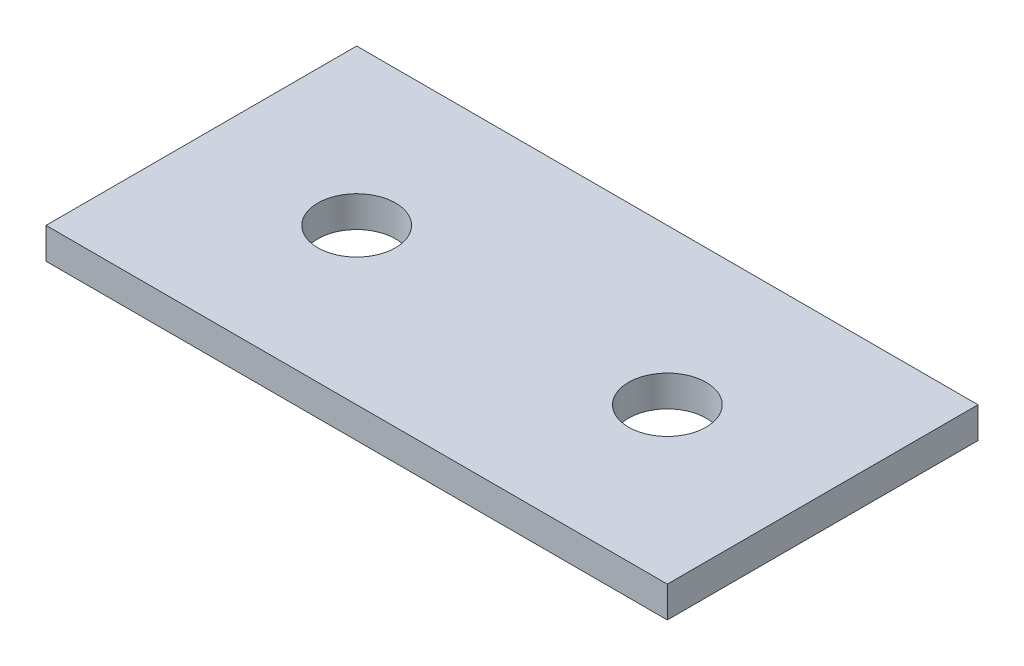
ISO-10303-21;
HEADER;
FILE_DESCRIPTION(('STEP AP214'),'2;1');
FILE_NAME('part.step','',(''),(''),'','','');
FILE_SCHEMA(('AUTOMOTIVE_DESIGN { 1 0 10303 214 1 1 1 1 }'));
ENDSEC;
DATA;
#1=APPLICATION_CONTEXT('core data for automotive mechanical design processes');
#2=APPLICATION_PROTOCOL_DEFINITION('international standard','automotive_design',2000,#1);
#3=PRODUCT_CONTEXT('',#1,'mechanical');
#4=PRODUCT('Part','Part','',(#3));
#5=PRODUCT_RELATED_PRODUCT_CATEGORY('part','',(#4));
#6=PRODUCT_DEFINITION_FORMATION('','',#4);
#7=PRODUCT_DEFINITION_CONTEXT('part definition',#1,'design');
#8=PRODUCT_DEFINITION('design','',#6,#7);
#9=PRODUCT_DEFINITION_SHAPE('','',#8);
#10=(LENGTH_UNIT() NAMED_UNIT(*) SI_UNIT(.MILLI.,.METRE.));
#11=(NAMED_UNIT(*) PLANE_ANGLE_UNIT() SI_UNIT($,.RADIAN.));
#12=(NAMED_UNIT(*) SI_UNIT($,.STERADIAN.) SOLID_ANGLE_UNIT());
#13=UNCERTAINTY_MEASURE_WITH_UNIT(LENGTH_MEASURE(1.E-05),#10,'distance_accuracy_value','');
#14=(GEOMETRIC_REPRESENTATION_CONTEXT(3) GLOBAL_UNCERTAINTY_ASSIGNED_CONTEXT((#13)) GLOBAL_UNIT_ASSIGNED_CONTEXT((#10,
#11,#12)) REPRESENTATION_CONTEXT('',''));
#15=CARTESIAN_POINT('',(0.,0.,0.));
#16=DIRECTION('',(0.,0.,1.));
#17=DIRECTION('',(1.,0.,0.));
#18=AXIS2_PLACEMENT_3D('',#15,#16,#17);
#19=CARTESIAN_POINT('',(0.,2.54,0.));
#20=DIRECTION('',(0.,1.,0.));
#21=DIRECTION('',(0.,0.,1.));
#22=AXIS2_PLACEMENT_3D('',#19,#20,#21);
#23=PLANE('',#22);
#24=CARTESIAN_POINT('',(-38.1,2.54,-12.7));
#25=DIRECTION('',(0.,1.,0.));
#26=DIRECTION('',(0.,0.,1.));
#27=AXIS2_PLACEMENT_3D('',#24,#25,#26);
#28=CIRCLE('',#27,3.17500000000001);
#29=CARTESIAN_POINT('',(-38.1,2.54,-9.525));
#30=VERTEX_POINT('',#29);
#31=EDGE_CURVE('E118',#30,#30,#28,.T.);
#32=ORIENTED_EDGE('',*,*,#31,.F.);
#33=EDGE_LOOP('',(#32));
#34=FACE_BOUND('',#33,.T.);
#35=DIRECTION('',(0.,0.,1.));
#36=VECTOR('',#35,1.);
#37=CARTESIAN_POINT('',(-50.8,2.54,-25.4));
#38=LINE('',#37,#36);
#39=CARTESIAN_POINT('',(-50.8,2.54,-25.4));
#40=VERTEX_POINT('',#39);
#41=CARTESIAN_POINT('',(-50.8,2.54,0.));
#42=VERTEX_POINT('',#41);
#43=EDGE_CURVE('E98',#40,#42,#38,.T.);
#44=ORIENTED_EDGE('',*,*,#43,.T.);
#45=DIRECTION('',(1.,0.,0.));
#46=VECTOR('',#45,1.);
#47=CARTESIAN_POINT('',(-50.8,2.54,0.));
#48=LINE('',#47,#46);
#49=CARTESIAN_POINT('',(0.,2.54,0.));
#50=VERTEX_POINT('',#49);
#51=EDGE_CURVE('E93',#42,#50,#48,.T.);
#52=ORIENTED_EDGE('',*,*,#51,.T.);
#53=DIRECTION('',(0.,0.,-1.));
#54=VECTOR('',#53,1.);
#55=CARTESIAN_POINT('',(0.,2.54,-25.4));
#56=LINE('',#55,#54);
#57=CARTESIAN_POINT('',(0.,2.54,-25.4));
#58=VERTEX_POINT('',#57);
#59=EDGE_CURVE('E96',#50,#58,#56,.T.);
#60=ORIENTED_EDGE('',*,*,#59,.T.);
#61=DIRECTION('',(-1.,0.,0.));
#62=VECTOR('',#61,1.);
#63=CARTESIAN_POINT('',(-50.8,2.54,-25.4));
#64=LINE('',#63,#62);
#65=EDGE_CURVE('E63',#58,#40,#64,.T.);
#66=ORIENTED_EDGE('',*,*,#65,.T.);
#67=EDGE_LOOP('',(#44,#52,#60,#66));
#68=FACE_BOUND('',#67,.T.);
#69=CARTESIAN_POINT('',(-12.7,2.54,-12.7));
#70=DIRECTION('',(0.,1.,0.));
#71=DIRECTION('',(0.,0.,1.));
#72=AXIS2_PLACEMENT_3D('',#69,#70,#71);
#73=CIRCLE('',#72,3.175);
#74=CARTESIAN_POINT('',(-12.7,2.54,-9.525));
#75=VERTEX_POINT('',#74);
#76=EDGE_CURVE('E140',#75,#75,#73,.T.);
#77=ORIENTED_EDGE('',*,*,#76,.F.);
#78=EDGE_LOOP('',(#77));
#79=FACE_BOUND('',#78,.T.);
#80=ADVANCED_FACE('F45',(#34,#68,#79),#23,.T.);
#81=CARTESIAN_POINT('',(0.,0.,0.));
#82=DIRECTION('',(0.,1.,0.));
#83=DIRECTION('',(0.,0.,1.));
#84=AXIS2_PLACEMENT_3D('',#81,#82,#83);
#85=PLANE('',#84);
#86=DIRECTION('',(0.,0.,1.));
#87=VECTOR('',#86,1.);
#88=CARTESIAN_POINT('',(-50.8,0.,-25.4));
#89=LINE('',#88,#87);
#90=CARTESIAN_POINT('',(-50.8,0.,-25.4));
#91=VERTEX_POINT('',#90);
#92=CARTESIAN_POINT('',(-50.8,0.,0.));
#93=VERTEX_POINT('',#92);
#94=EDGE_CURVE('E114',#91,#93,#89,.T.);
#95=ORIENTED_EDGE('',*,*,#94,.F.);
#96=DIRECTION('',(-1.,0.,0.));
#97=VECTOR('',#96,1.);
#98=CARTESIAN_POINT('',(-50.8,0.,-25.4));
#99=LINE('',#98,#97);
#100=CARTESIAN_POINT('',(0.,0.,-25.4));
#101=VERTEX_POINT('',#100);
#102=EDGE_CURVE('E86',#101,#91,#99,.T.);
#103=ORIENTED_EDGE('',*,*,#102,.F.);
#104=DIRECTION('',(0.,0.,-1.));
#105=VECTOR('',#104,1.);
#106=CARTESIAN_POINT('',(0.,0.,-25.4));
#107=LINE('',#106,#105);
#108=CARTESIAN_POINT('',(0.,0.,0.));
#109=VERTEX_POINT('',#108);
#110=EDGE_CURVE('E80',#109,#101,#107,.T.);
#111=ORIENTED_EDGE('',*,*,#110,.F.);
#112=DIRECTION('',(1.,0.,0.));
#113=VECTOR('',#112,1.);
#114=CARTESIAN_POINT('',(-50.8,0.,0.));
#115=LINE('',#114,#113);
#116=EDGE_CURVE('E103',#93,#109,#115,.T.);
#117=ORIENTED_EDGE('',*,*,#116,.F.);
#118=EDGE_LOOP('',(#95,#103,#111,#117));
#119=FACE_BOUND('',#118,.T.);
#120=CARTESIAN_POINT('',(-38.1,0.,-12.7));
#121=DIRECTION('',(0.,1.,0.));
#122=DIRECTION('',(0.,0.,1.));
#123=AXIS2_PLACEMENT_3D('',#120,#121,#122);
#124=CIRCLE('',#123,3.17500000000001);
#125=CARTESIAN_POINT('',(-38.1,0.,-9.525));
#126=VERTEX_POINT('',#125);
#127=EDGE_CURVE('E136',#126,#126,#124,.T.);
#128=ORIENTED_EDGE('',*,*,#127,.T.);
#129=EDGE_LOOP('',(#128));
#130=FACE_BOUND('',#129,.T.);
#131=CARTESIAN_POINT('',(-12.7,0.,-12.7));
#132=DIRECTION('',(0.,1.,0.));
#133=DIRECTION('',(0.,0.,1.));
#134=AXIS2_PLACEMENT_3D('',#131,#132,#133);
#135=CIRCLE('',#134,3.175);
#136=CARTESIAN_POINT('',(-12.7,0.,-9.525));
#137=VERTEX_POINT('',#136);
#138=EDGE_CURVE('E144',#137,#137,#135,.T.);
#139=ORIENTED_EDGE('',*,*,#138,.T.);
#140=EDGE_LOOP('',(#139));
#141=FACE_BOUND('',#140,.T.);
#142=ADVANCED_FACE('F131',(#119,#130,#141),#85,.F.);
#143=CARTESIAN_POINT('',(-50.8,2.54,-25.4));
#144=DIRECTION('',(1.,0.,0.));
#145=DIRECTION('',(0.,0.,-1.));
#146=AXIS2_PLACEMENT_3D('',#143,#144,#145);
#147=PLANE('',#146);
#148=ORIENTED_EDGE('',*,*,#94,.T.);
#149=DIRECTION('',(0.,-1.,0.));
#150=VECTOR('',#149,1.);
#151=CARTESIAN_POINT('',(-50.8,2.54,0.));
#152=LINE('',#151,#150);
#153=EDGE_CURVE('E11',#42,#93,#152,.T.);
#154=ORIENTED_EDGE('',*,*,#153,.F.);
#155=ORIENTED_EDGE('',*,*,#43,.F.);
#156=DIRECTION('',(0.,-1.,0.));
#157=VECTOR('',#156,1.);
#158=CARTESIAN_POINT('',(-50.8,2.54,-25.4));
#159=LINE('',#158,#157);
#160=EDGE_CURVE('E110',#40,#91,#159,.T.);
#161=ORIENTED_EDGE('',*,*,#160,.T.);
#162=EDGE_LOOP('',(#148,#154,#155,#161));
#163=FACE_BOUND('',#162,.T.);
#164=ADVANCED_FACE('F47',(#163),#147,.F.);
#165=CARTESIAN_POINT('',(-50.8,2.54,0.));
#166=DIRECTION('',(0.,0.,-1.));
#167=DIRECTION('',(-1.,0.,0.));
#168=AXIS2_PLACEMENT_3D('',#165,#166,#167);
#169=PLANE('',#168);
#170=ORIENTED_EDGE('',*,*,#116,.T.);
#171=DIRECTION('',(0.,-1.,0.));
#172=VECTOR('',#171,1.);
#173=CARTESIAN_POINT('',(0.,2.54,0.));
#174=LINE('',#173,#172);
#175=EDGE_CURVE('E55',#50,#109,#174,.T.);
#176=ORIENTED_EDGE('',*,*,#175,.F.);
#177=ORIENTED_EDGE('',*,*,#51,.F.);
#178=ORIENTED_EDGE('',*,*,#153,.T.);
#179=EDGE_LOOP('',(#170,#176,#177,#178));
#180=FACE_BOUND('',#179,.T.);
#181=ADVANCED_FACE('F102',(#180),#169,.F.);
#182=CARTESIAN_POINT('',(0.,2.54,-25.4));
#183=DIRECTION('',(-1.,0.,0.));
#184=DIRECTION('',(0.,0.,1.));
#185=AXIS2_PLACEMENT_3D('',#182,#183,#184);
#186=PLANE('',#185);
#187=ORIENTED_EDGE('',*,*,#110,.T.);
#188=DIRECTION('',(0.,-1.,0.));
#189=VECTOR('',#188,1.);
#190=CARTESIAN_POINT('',(0.,2.54,-25.4));
#191=LINE('',#190,#189);
#192=EDGE_CURVE('E105',#58,#101,#191,.T.);
#193=ORIENTED_EDGE('',*,*,#192,.F.);
#194=ORIENTED_EDGE('',*,*,#59,.F.);
#195=ORIENTED_EDGE('',*,*,#175,.T.);
#196=EDGE_LOOP('',(#187,#193,#194,#195));
#197=FACE_BOUND('',#196,.T.);
#198=ADVANCED_FACE('F106',(#197),#186,.F.);
#199=CARTESIAN_POINT('',(-50.8,2.54,-25.4));
#200=DIRECTION('',(0.,0.,1.));
#201=DIRECTION('',(1.,0.,0.));
#202=AXIS2_PLACEMENT_3D('',#199,#200,#201);
#203=PLANE('',#202);
#204=ORIENTED_EDGE('',*,*,#102,.T.);
#205=ORIENTED_EDGE('',*,*,#160,.F.);
#206=ORIENTED_EDGE('',*,*,#65,.F.);
#207=ORIENTED_EDGE('',*,*,#192,.T.);
#208=EDGE_LOOP('',(#204,#205,#206,#207));
#209=FACE_BOUND('',#208,.T.);
#210=ADVANCED_FACE('F128',(#209),#203,.F.);
#211=CARTESIAN_POINT('',(-38.1,2.54,-12.7));
#212=DIRECTION('',(0.,-1.,0.));
#213=DIRECTION('',(0.,0.,-1.));
#214=AXIS2_PLACEMENT_3D('',#211,#212,#213);
#215=CYLINDRICAL_SURFACE('',#214,3.17500000000001);
#216=ORIENTED_EDGE('',*,*,#31,.T.);
#217=EDGE_LOOP('',(#216));
#218=FACE_BOUND('',#217,.T.);
#219=ORIENTED_EDGE('',*,*,#127,.F.);
#220=EDGE_LOOP('',(#219));
#221=FACE_BOUND('',#220,.T.);
#222=ADVANCED_FACE('F163',(#218,#221),#215,.F.);
#223=CARTESIAN_POINT('',(-12.7,2.54,-12.7));
#224=DIRECTION('',(0.,-1.,0.));
#225=DIRECTION('',(0.,0.,-1.));
#226=AXIS2_PLACEMENT_3D('',#223,#224,#225);
#227=CYLINDRICAL_SURFACE('',#226,3.175);
#228=ORIENTED_EDGE('',*,*,#76,.T.);
#229=EDGE_LOOP('',(#228));
#230=FACE_BOUND('',#229,.T.);
#231=ORIENTED_EDGE('',*,*,#138,.F.);
#232=EDGE_LOOP('',(#231));
#233=FACE_BOUND('',#232,.T.);
#234=ADVANCED_FACE('F152',(#230,#233),#227,.F.);
#235=CLOSED_SHELL('',(#80,#142,#164,#181,#198,#210,#222,#234));
#236=MANIFOLD_SOLID_BREP('B2',#235);
#237=ADVANCED_BREP_SHAPE_REPRESENTATION('',(#18,#236),#14);
#238=SHAPE_DEFINITION_REPRESENTATION(#9,#237);
ENDSEC;
END-ISO-10303-21;
